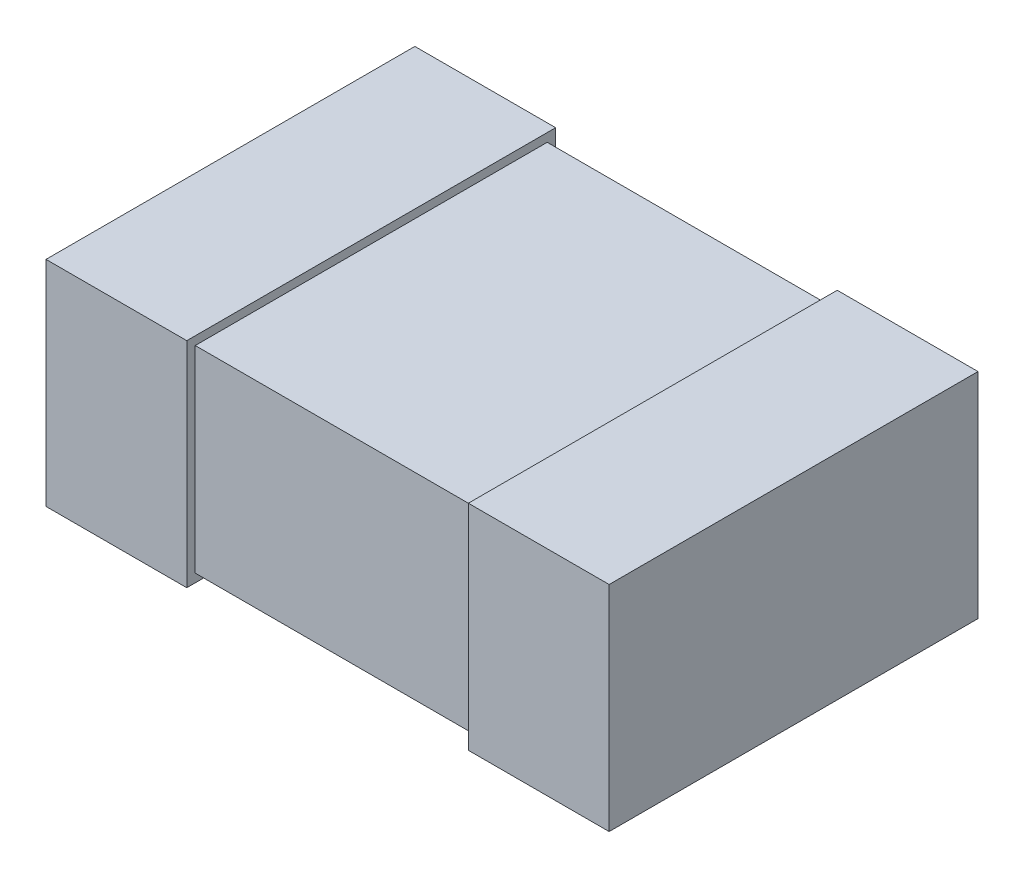
ISO-10303-21;
HEADER;
FILE_DESCRIPTION(('STEP AP214'),'2;1');
FILE_NAME('part.step','',(''),(''),'','','');
FILE_SCHEMA(('AUTOMOTIVE_DESIGN { 1 0 10303 214 1 1 1 1 }'));
ENDSEC;
DATA;
#1=APPLICATION_CONTEXT('core data for automotive mechanical design processes');
#2=APPLICATION_PROTOCOL_DEFINITION('international standard','automotive_design',2000,#1);
#3=PRODUCT_CONTEXT('',#1,'mechanical');
#4=PRODUCT('Part','Part','',(#3));
#5=PRODUCT_RELATED_PRODUCT_CATEGORY('part','',(#4));
#6=PRODUCT_DEFINITION_FORMATION('','',#4);
#7=PRODUCT_DEFINITION_CONTEXT('part definition',#1,'design');
#8=PRODUCT_DEFINITION('design','',#6,#7);
#9=PRODUCT_DEFINITION_SHAPE('','',#8);
#10=(LENGTH_UNIT() NAMED_UNIT(*) SI_UNIT(.MILLI.,.METRE.));
#11=(NAMED_UNIT(*) PLANE_ANGLE_UNIT() SI_UNIT($,.RADIAN.));
#12=(NAMED_UNIT(*) SI_UNIT($,.STERADIAN.) SOLID_ANGLE_UNIT());
#13=UNCERTAINTY_MEASURE_WITH_UNIT(LENGTH_MEASURE(1.E-05),#10,'distance_accuracy_value','');
#14=(GEOMETRIC_REPRESENTATION_CONTEXT(3) GLOBAL_UNCERTAINTY_ASSIGNED_CONTEXT((#13)) GLOBAL_UNIT_ASSIGNED_CONTEXT((#10,
#11,#12)) REPRESENTATION_CONTEXT('',''));
#15=CARTESIAN_POINT('',(0.,0.,0.));
#16=DIRECTION('',(0.,0.,1.));
#17=DIRECTION('',(1.,0.,0.));
#18=AXIS2_PLACEMENT_3D('',#15,#16,#17);
#19=CARTESIAN_POINT('',(-1.,0.7,0.625));
#20=DIRECTION('',(0.,0.,-1.));
#21=DIRECTION('',(-1.,0.,0.));
#22=AXIS2_PLACEMENT_3D('',#19,#20,#21);
#23=PLANE('',#22);
#24=DIRECTION('',(0.,-1.,0.));
#25=VECTOR('',#24,1.);
#26=CARTESIAN_POINT('',(0.5,0.7,0.625));
#27=LINE('',#26,#25);
#28=CARTESIAN_POINT('',(0.5,0.7,0.625));
#29=VERTEX_POINT('',#28);
#30=CARTESIAN_POINT('',(0.5,0.,0.625));
#31=VERTEX_POINT('',#30);
#32=EDGE_CURVE('E51',#29,#31,#27,.T.);
#33=ORIENTED_EDGE('',*,*,#32,.F.);
#34=DIRECTION('',(1.,0.,0.));
#35=VECTOR('',#34,1.);
#36=CARTESIAN_POINT('',(-1.,0.7,0.625));
#37=LINE('',#36,#35);
#38=CARTESIAN_POINT('',(-0.5,0.7,0.625));
#39=VERTEX_POINT('',#38);
#40=EDGE_CURVE('E216',#39,#29,#37,.T.);
#41=ORIENTED_EDGE('',*,*,#40,.F.);
#42=DIRECTION('',(0.,1.,0.));
#43=VECTOR('',#42,1.);
#44=CARTESIAN_POINT('',(-0.5,0.7,0.625));
#45=LINE('',#44,#43);
#46=CARTESIAN_POINT('',(-0.5,0.,0.625));
#47=VERTEX_POINT('',#46);
#48=EDGE_CURVE('E210',#47,#39,#45,.T.);
#49=ORIENTED_EDGE('',*,*,#48,.F.);
#50=DIRECTION('',(1.,0.,0.));
#51=VECTOR('',#50,1.);
#52=CARTESIAN_POINT('',(-1.,0.,0.625));
#53=LINE('',#52,#51);
#54=EDGE_CURVE('E215',#47,#31,#53,.T.);
#55=ORIENTED_EDGE('',*,*,#54,.T.);
#56=EDGE_LOOP('',(#33,#41,#49,#55));
#57=FACE_BOUND('',#56,.T.);
#58=ADVANCED_FACE('F36',(#57),#23,.F.);
#59=CARTESIAN_POINT('',(-1.,0.7,-0.625));
#60=DIRECTION('',(0.,0.,1.));
#61=DIRECTION('',(1.,0.,0.));
#62=AXIS2_PLACEMENT_3D('',#59,#60,#61);
#63=PLANE('',#62);
#64=DIRECTION('',(0.,1.,0.));
#65=VECTOR('',#64,1.);
#66=CARTESIAN_POINT('',(0.5,0.7,-0.625));
#67=LINE('',#66,#65);
#68=CARTESIAN_POINT('',(0.5,0.,-0.625));
#69=VERTEX_POINT('',#68);
#70=CARTESIAN_POINT('',(0.5,0.7,-0.625));
#71=VERTEX_POINT('',#70);
#72=EDGE_CURVE('E165',#69,#71,#67,.T.);
#73=ORIENTED_EDGE('',*,*,#72,.F.);
#74=DIRECTION('',(-1.,0.,0.));
#75=VECTOR('',#74,1.);
#76=CARTESIAN_POINT('',(-1.,0.,-0.625));
#77=LINE('',#76,#75);
#78=CARTESIAN_POINT('',(-0.5,0.,-0.625));
#79=VERTEX_POINT('',#78);
#80=EDGE_CURVE('E219',#69,#79,#77,.T.);
#81=ORIENTED_EDGE('',*,*,#80,.T.);
#82=DIRECTION('',(0.,-1.,0.));
#83=VECTOR('',#82,1.);
#84=CARTESIAN_POINT('',(-0.5,0.7,-0.625));
#85=LINE('',#84,#83);
#86=CARTESIAN_POINT('',(-0.5,0.7,-0.625));
#87=VERTEX_POINT('',#86);
#88=EDGE_CURVE('E198',#87,#79,#85,.T.);
#89=ORIENTED_EDGE('',*,*,#88,.F.);
#90=DIRECTION('',(-1.,0.,0.));
#91=VECTOR('',#90,1.);
#92=CARTESIAN_POINT('',(-1.,0.7,-0.625));
#93=LINE('',#92,#91);
#94=EDGE_CURVE('E218',#71,#87,#93,.T.);
#95=ORIENTED_EDGE('',*,*,#94,.F.);
#96=EDGE_LOOP('',(#73,#81,#89,#95));
#97=FACE_BOUND('',#96,.T.);
#98=ADVANCED_FACE('F236',(#97),#63,.F.);
#99=CARTESIAN_POINT('',(-1.,0.7,0.625));
#100=DIRECTION('',(0.,1.,0.));
#101=DIRECTION('',(0.,0.,1.));
#102=AXIS2_PLACEMENT_3D('',#99,#100,#101);
#103=PLANE('',#102);
#104=ORIENTED_EDGE('',*,*,#40,.T.);
#105=DIRECTION('',(0.,0.,-1.));
#106=VECTOR('',#105,1.);
#107=CARTESIAN_POINT('',(0.5,0.7,0.625));
#108=LINE('',#107,#106);
#109=EDGE_CURVE('E58',#29,#71,#108,.T.);
#110=ORIENTED_EDGE('',*,*,#109,.T.);
#111=ORIENTED_EDGE('',*,*,#94,.T.);
#112=DIRECTION('',(0.,0.,1.));
#113=VECTOR('',#112,1.);
#114=CARTESIAN_POINT('',(-0.5,0.7,0.625));
#115=LINE('',#114,#113);
#116=EDGE_CURVE('E213',#87,#39,#115,.T.);
#117=ORIENTED_EDGE('',*,*,#116,.T.);
#118=EDGE_LOOP('',(#104,#110,#111,#117));
#119=FACE_BOUND('',#118,.T.);
#120=ADVANCED_FACE('F233',(#119),#103,.T.);
#121=CARTESIAN_POINT('',(-1.,0.,0.625));
#122=DIRECTION('',(0.,1.,0.));
#123=DIRECTION('',(0.,0.,1.));
#124=AXIS2_PLACEMENT_3D('',#121,#122,#123);
#125=PLANE('',#124);
#126=DIRECTION('',(0.,0.,-1.));
#127=VECTOR('',#126,1.);
#128=CARTESIAN_POINT('',(0.5,0.,0.625));
#129=LINE('',#128,#127);
#130=EDGE_CURVE('E12',#31,#69,#129,.T.);
#131=ORIENTED_EDGE('',*,*,#130,.F.);
#132=ORIENTED_EDGE('',*,*,#54,.F.);
#133=DIRECTION('',(0.,0.,1.));
#134=VECTOR('',#133,1.);
#135=CARTESIAN_POINT('',(-0.5,0.,0.625));
#136=LINE('',#135,#134);
#137=EDGE_CURVE('E44',#79,#47,#136,.T.);
#138=ORIENTED_EDGE('',*,*,#137,.F.);
#139=ORIENTED_EDGE('',*,*,#80,.F.);
#140=EDGE_LOOP('',(#131,#132,#138,#139));
#141=FACE_BOUND('',#140,.T.);
#142=ADVANCED_FACE('F231',(#141),#125,.F.);
#143=CARTESIAN_POINT('',(-0.5,-0.0299999999999997,1.59472523324353));
#144=DIRECTION('',(0.,1.,0.));
#145=DIRECTION('',(-1.,0.,0.));
#146=AXIS2_PLACEMENT_3D('',#143,#144,#145);
#147=PLANE('',#146);
#148=DIRECTION('',(0.,0.,-1.));
#149=VECTOR('',#148,1.);
#150=CARTESIAN_POINT('',(-0.5,-0.0299999999999997,1.59472523324353));
#151=LINE('',#150,#149);
#152=CARTESIAN_POINT('',(-0.5,-0.0299999999999997,0.655));
#153=VERTEX_POINT('',#152);
#154=CARTESIAN_POINT('',(-0.5,-0.0299999999999997,-0.655));
#155=VERTEX_POINT('',#154);
#156=EDGE_CURVE('E187',#153,#155,#151,.T.);
#157=ORIENTED_EDGE('',*,*,#156,.F.);
#158=DIRECTION('',(-1.,0.,0.));
#159=VECTOR('',#158,1.);
#160=CARTESIAN_POINT('',(-0.5,-0.0299999999999997,0.655));
#161=LINE('',#160,#159);
#162=CARTESIAN_POINT('',(-1.,-0.0299999999999998,0.655));
#163=VERTEX_POINT('',#162);
#164=EDGE_CURVE('E192',#153,#163,#161,.T.);
#165=ORIENTED_EDGE('',*,*,#164,.T.);
#166=DIRECTION('',(0.,0.,-1.));
#167=VECTOR('',#166,1.);
#168=CARTESIAN_POINT('',(-1.,-0.0299999999999998,1.59472523324353));
#169=LINE('',#168,#167);
#170=CARTESIAN_POINT('',(-1.,-0.0299999999999998,-0.655));
#171=VERTEX_POINT('',#170);
#172=EDGE_CURVE('E200',#163,#171,#169,.T.);
#173=ORIENTED_EDGE('',*,*,#172,.T.);
#174=DIRECTION('',(-1.,0.,0.));
#175=VECTOR('',#174,1.);
#176=CARTESIAN_POINT('',(-0.5,-0.0299999999999997,-0.655));
#177=LINE('',#176,#175);
#178=EDGE_CURVE('E178',#155,#171,#177,.T.);
#179=ORIENTED_EDGE('',*,*,#178,.F.);
#180=EDGE_LOOP('',(#157,#165,#173,#179));
#181=FACE_BOUND('',#180,.T.);
#182=ADVANCED_FACE('F277',(#181),#147,.F.);
#183=CARTESIAN_POINT('',(-0.5,0.73,1.59472523324353));
#184=DIRECTION('',(0.,-1.,0.));
#185=DIRECTION('',(1.,0.,0.));
#186=AXIS2_PLACEMENT_3D('',#183,#184,#185);
#187=PLANE('',#186);
#188=DIRECTION('',(0.,0.,-1.));
#189=VECTOR('',#188,1.);
#190=CARTESIAN_POINT('',(-1.,0.73,1.59472523324353));
#191=LINE('',#190,#189);
#192=CARTESIAN_POINT('',(-1.,0.73,0.655));
#193=VERTEX_POINT('',#192);
#194=CARTESIAN_POINT('',(-1.,0.73,-0.655));
#195=VERTEX_POINT('',#194);
#196=EDGE_CURVE('E202',#193,#195,#191,.T.);
#197=ORIENTED_EDGE('',*,*,#196,.F.);
#198=DIRECTION('',(1.,0.,0.));
#199=VECTOR('',#198,1.);
#200=CARTESIAN_POINT('',(-0.5,0.73,0.655));
#201=LINE('',#200,#199);
#202=CARTESIAN_POINT('',(-0.5,0.73,0.655));
#203=VERTEX_POINT('',#202);
#204=EDGE_CURVE('E191',#193,#203,#201,.T.);
#205=ORIENTED_EDGE('',*,*,#204,.T.);
#206=DIRECTION('',(0.,0.,-1.));
#207=VECTOR('',#206,1.);
#208=CARTESIAN_POINT('',(-0.5,0.73,1.59472523324353));
#209=LINE('',#208,#207);
#210=CARTESIAN_POINT('',(-0.5,0.73,-0.655));
#211=VERTEX_POINT('',#210);
#212=EDGE_CURVE('E204',#203,#211,#209,.T.);
#213=ORIENTED_EDGE('',*,*,#212,.T.);
#214=DIRECTION('',(1.,0.,0.));
#215=VECTOR('',#214,1.);
#216=CARTESIAN_POINT('',(-0.5,0.73,-0.655));
#217=LINE('',#216,#215);
#218=EDGE_CURVE('E184',#195,#211,#217,.T.);
#219=ORIENTED_EDGE('',*,*,#218,.F.);
#220=EDGE_LOOP('',(#197,#205,#213,#219));
#221=FACE_BOUND('',#220,.T.);
#222=ADVANCED_FACE('F280',(#221),#187,.F.);
#223=CARTESIAN_POINT('',(-0.5,0.73,1.59472523324353));
#224=DIRECTION('',(-1.,0.,0.));
#225=DIRECTION('',(0.,0.,1.));
#226=AXIS2_PLACEMENT_3D('',#223,#224,#225);
#227=PLANE('',#226);
#228=ORIENTED_EDGE('',*,*,#116,.F.);
#229=ORIENTED_EDGE('',*,*,#88,.T.);
#230=ORIENTED_EDGE('',*,*,#137,.T.);
#231=ORIENTED_EDGE('',*,*,#48,.T.);
#232=EDGE_LOOP('',(#228,#229,#230,#231));
#233=FACE_BOUND('',#232,.T.);
#234=ORIENTED_EDGE('',*,*,#212,.F.);
#235=DIRECTION('',(0.,-1.,0.));
#236=VECTOR('',#235,1.);
#237=CARTESIAN_POINT('',(-0.5,0.73,0.655));
#238=LINE('',#237,#236);
#239=EDGE_CURVE('E195',#203,#153,#238,.T.);
#240=ORIENTED_EDGE('',*,*,#239,.T.);
#241=ORIENTED_EDGE('',*,*,#156,.T.);
#242=DIRECTION('',(0.,-1.,0.));
#243=VECTOR('',#242,1.);
#244=CARTESIAN_POINT('',(-0.5,0.73,-0.655));
#245=LINE('',#244,#243);
#246=EDGE_CURVE('E181',#211,#155,#245,.T.);
#247=ORIENTED_EDGE('',*,*,#246,.F.);
#248=EDGE_LOOP('',(#234,#240,#241,#247));
#249=FACE_BOUND('',#248,.T.);
#250=ADVANCED_FACE('F226',(#233,#249),#227,.F.);
#251=CARTESIAN_POINT('',(-1.,0.7,0.655));
#252=DIRECTION('',(0.,0.,-1.));
#253=DIRECTION('',(-1.,0.,0.));
#254=AXIS2_PLACEMENT_3D('',#251,#252,#253);
#255=PLANE('',#254);
#256=ORIENTED_EDGE('',*,*,#204,.F.);
#257=DIRECTION('',(0.,1.,0.));
#258=VECTOR('',#257,1.);
#259=CARTESIAN_POINT('',(-1.,0.73,0.655));
#260=LINE('',#259,#258);
#261=EDGE_CURVE('E188',#163,#193,#260,.T.);
#262=ORIENTED_EDGE('',*,*,#261,.F.);
#263=ORIENTED_EDGE('',*,*,#164,.F.);
#264=ORIENTED_EDGE('',*,*,#239,.F.);
#265=EDGE_LOOP('',(#256,#262,#263,#264));
#266=FACE_BOUND('',#265,.T.);
#267=ADVANCED_FACE('F272',(#266),#255,.F.);
#268=CARTESIAN_POINT('',(-1.,0.7,-0.655));
#269=DIRECTION('',(0.,0.,1.));
#270=DIRECTION('',(1.,0.,0.));
#271=AXIS2_PLACEMENT_3D('',#268,#269,#270);
#272=PLANE('',#271);
#273=ORIENTED_EDGE('',*,*,#246,.T.);
#274=ORIENTED_EDGE('',*,*,#178,.T.);
#275=DIRECTION('',(0.,1.,0.));
#276=VECTOR('',#275,1.);
#277=CARTESIAN_POINT('',(-1.,0.73,-0.655));
#278=LINE('',#277,#276);
#279=EDGE_CURVE('E175',#171,#195,#278,.T.);
#280=ORIENTED_EDGE('',*,*,#279,.T.);
#281=ORIENTED_EDGE('',*,*,#218,.T.);
#282=EDGE_LOOP('',(#273,#274,#280,#281));
#283=FACE_BOUND('',#282,.T.);
#284=ADVANCED_FACE('F269',(#283),#272,.F.);
#285=CARTESIAN_POINT('',(-1.,0.7,-0.625));
#286=DIRECTION('',(1.,0.,0.));
#287=DIRECTION('',(0.,0.,-1.));
#288=AXIS2_PLACEMENT_3D('',#285,#286,#287);
#289=PLANE('',#288);
#290=ORIENTED_EDGE('',*,*,#172,.F.);
#291=ORIENTED_EDGE('',*,*,#261,.T.);
#292=ORIENTED_EDGE('',*,*,#196,.T.);
#293=ORIENTED_EDGE('',*,*,#279,.F.);
#294=EDGE_LOOP('',(#290,#291,#292,#293));
#295=FACE_BOUND('',#294,.T.);
#296=ADVANCED_FACE('F38',(#295),#289,.F.);
#297=CARTESIAN_POINT('',(0.5,-0.0299999999999996,1.59472523324353));
#298=DIRECTION('',(0.,1.,0.));
#299=DIRECTION('',(-1.,0.,0.));
#300=AXIS2_PLACEMENT_3D('',#297,#298,#299);
#301=PLANE('',#300);
#302=DIRECTION('',(0.,0.,-1.));
#303=VECTOR('',#302,1.);
#304=CARTESIAN_POINT('',(1.,-0.0299999999999995,1.59472523324353));
#305=LINE('',#304,#303);
#306=CARTESIAN_POINT('',(1.,-0.0299999999999995,0.655));
#307=VERTEX_POINT('',#306);
#308=CARTESIAN_POINT('',(1.,-0.0299999999999995,-0.655));
#309=VERTEX_POINT('',#308);
#310=EDGE_CURVE('E138',#307,#309,#305,.T.);
#311=ORIENTED_EDGE('',*,*,#310,.F.);
#312=DIRECTION('',(-1.,0.,0.));
#313=VECTOR('',#312,1.);
#314=CARTESIAN_POINT('',(0.5,-0.0299999999999996,0.655));
#315=LINE('',#314,#313);
#316=CARTESIAN_POINT('',(0.5,-0.0299999999999996,0.655));
#317=VERTEX_POINT('',#316);
#318=EDGE_CURVE('E133',#307,#317,#315,.T.);
#319=ORIENTED_EDGE('',*,*,#318,.T.);
#320=DIRECTION('',(0.,0.,-1.));
#321=VECTOR('',#320,1.);
#322=CARTESIAN_POINT('',(0.5,-0.0299999999999996,1.59472523324353));
#323=LINE('',#322,#321);
#324=CARTESIAN_POINT('',(0.5,-0.0299999999999996,-0.655));
#325=VERTEX_POINT('',#324);
#326=EDGE_CURVE('E128',#317,#325,#323,.T.);
#327=ORIENTED_EDGE('',*,*,#326,.T.);
#328=DIRECTION('',(-1.,0.,0.));
#329=VECTOR('',#328,1.);
#330=CARTESIAN_POINT('',(0.500000000000001,-0.0299999999999996,-0.655));
#331=LINE('',#330,#329);
#332=EDGE_CURVE('E132',#309,#325,#331,.T.);
#333=ORIENTED_EDGE('',*,*,#332,.F.);
#334=EDGE_LOOP('',(#311,#319,#327,#333));
#335=FACE_BOUND('',#334,.T.);
#336=ADVANCED_FACE('F131',(#335),#301,.F.);
#337=CARTESIAN_POINT('',(0.5,0.73,1.59472523324353));
#338=DIRECTION('',(1.,0.,0.));
#339=DIRECTION('',(0.,0.,-1.));
#340=AXIS2_PLACEMENT_3D('',#337,#338,#339);
#341=PLANE('',#340);
#342=ORIENTED_EDGE('',*,*,#109,.F.);
#343=ORIENTED_EDGE('',*,*,#32,.T.);
#344=ORIENTED_EDGE('',*,*,#130,.T.);
#345=ORIENTED_EDGE('',*,*,#72,.T.);
#346=EDGE_LOOP('',(#342,#343,#344,#345));
#347=FACE_BOUND('',#346,.T.);
#348=ORIENTED_EDGE('',*,*,#326,.F.);
#349=DIRECTION('',(0.,1.,0.));
#350=VECTOR('',#349,1.);
#351=CARTESIAN_POINT('',(0.5,0.73,0.655));
#352=LINE('',#351,#350);
#353=CARTESIAN_POINT('',(0.5,0.73,0.655));
#354=VERTEX_POINT('',#353);
#355=EDGE_CURVE('E160',#317,#354,#352,.T.);
#356=ORIENTED_EDGE('',*,*,#355,.T.);
#357=DIRECTION('',(0.,0.,-1.));
#358=VECTOR('',#357,1.);
#359=CARTESIAN_POINT('',(0.5,0.73,1.59472523324353));
#360=LINE('',#359,#358);
#361=CARTESIAN_POINT('',(0.5,0.73,-0.655));
#362=VERTEX_POINT('',#361);
#363=EDGE_CURVE('E137',#354,#362,#360,.T.);
#364=ORIENTED_EDGE('',*,*,#363,.T.);
#365=DIRECTION('',(0.,1.,0.));
#366=VECTOR('',#365,1.);
#367=CARTESIAN_POINT('',(0.5,0.73,-0.655));
#368=LINE('',#367,#366);
#369=EDGE_CURVE('E145',#325,#362,#368,.T.);
#370=ORIENTED_EDGE('',*,*,#369,.F.);
#371=EDGE_LOOP('',(#348,#356,#364,#370));
#372=FACE_BOUND('',#371,.T.);
#373=ADVANCED_FACE('F150',(#347,#372),#341,.F.);
#374=CARTESIAN_POINT('',(0.5,0.73,1.59472523324353));
#375=DIRECTION('',(0.,-1.,0.));
#376=DIRECTION('',(0.,0.,-1.));
#377=AXIS2_PLACEMENT_3D('',#374,#375,#376);
#378=PLANE('',#377);
#379=ORIENTED_EDGE('',*,*,#363,.F.);
#380=DIRECTION('',(1.,0.,0.));
#381=VECTOR('',#380,1.);
#382=CARTESIAN_POINT('',(0.5,0.73,0.655));
#383=LINE('',#382,#381);
#384=CARTESIAN_POINT('',(1.,0.73,0.655));
#385=VERTEX_POINT('',#384);
#386=EDGE_CURVE('E163',#354,#385,#383,.T.);
#387=ORIENTED_EDGE('',*,*,#386,.T.);
#388=DIRECTION('',(0.,0.,-1.));
#389=VECTOR('',#388,1.);
#390=CARTESIAN_POINT('',(1.,0.73,1.59472523324353));
#391=LINE('',#390,#389);
#392=CARTESIAN_POINT('',(1.,0.73,-0.655));
#393=VERTEX_POINT('',#392);
#394=EDGE_CURVE('E152',#385,#393,#391,.T.);
#395=ORIENTED_EDGE('',*,*,#394,.T.);
#396=DIRECTION('',(1.,0.,0.));
#397=VECTOR('',#396,1.);
#398=CARTESIAN_POINT('',(0.500000000000001,0.73,-0.655));
#399=LINE('',#398,#397);
#400=EDGE_CURVE('E153',#362,#393,#399,.T.);
#401=ORIENTED_EDGE('',*,*,#400,.F.);
#402=EDGE_LOOP('',(#379,#387,#395,#401));
#403=FACE_BOUND('',#402,.T.);
#404=ADVANCED_FACE('F256',(#403),#378,.F.);
#405=CARTESIAN_POINT('',(-1.,0.7,0.655));
#406=DIRECTION('',(0.,0.,-1.));
#407=DIRECTION('',(-1.,0.,0.));
#408=AXIS2_PLACEMENT_3D('',#405,#406,#407);
#409=PLANE('',#408);
#410=ORIENTED_EDGE('',*,*,#355,.F.);
#411=ORIENTED_EDGE('',*,*,#318,.F.);
#412=DIRECTION('',(0.,-1.,0.));
#413=VECTOR('',#412,1.);
#414=CARTESIAN_POINT('',(1.,0.73,0.655));
#415=LINE('',#414,#413);
#416=EDGE_CURVE('E161',#385,#307,#415,.T.);
#417=ORIENTED_EDGE('',*,*,#416,.F.);
#418=ORIENTED_EDGE('',*,*,#386,.F.);
#419=EDGE_LOOP('',(#410,#411,#417,#418));
#420=FACE_BOUND('',#419,.T.);
#421=ADVANCED_FACE('F252',(#420),#409,.F.);
#422=CARTESIAN_POINT('',(-1.,0.7,-0.655));
#423=DIRECTION('',(0.,0.,1.));
#424=DIRECTION('',(1.,0.,0.));
#425=AXIS2_PLACEMENT_3D('',#422,#423,#424);
#426=PLANE('',#425);
#427=ORIENTED_EDGE('',*,*,#400,.T.);
#428=DIRECTION('',(0.,-1.,0.));
#429=VECTOR('',#428,1.);
#430=CARTESIAN_POINT('',(1.,0.73,-0.655));
#431=LINE('',#430,#429);
#432=EDGE_CURVE('E148',#393,#309,#431,.T.);
#433=ORIENTED_EDGE('',*,*,#432,.T.);
#434=ORIENTED_EDGE('',*,*,#332,.T.);
#435=ORIENTED_EDGE('',*,*,#369,.T.);
#436=EDGE_LOOP('',(#427,#433,#434,#435));
#437=FACE_BOUND('',#436,.T.);
#438=ADVANCED_FACE('F144',(#437),#426,.F.);
#439=CARTESIAN_POINT('',(1.,0.7,-0.625));
#440=DIRECTION('',(-1.,0.,0.));
#441=DIRECTION('',(0.,0.,1.));
#442=AXIS2_PLACEMENT_3D('',#439,#440,#441);
#443=PLANE('',#442);
#444=ORIENTED_EDGE('',*,*,#394,.F.);
#445=ORIENTED_EDGE('',*,*,#416,.T.);
#446=ORIENTED_EDGE('',*,*,#310,.T.);
#447=ORIENTED_EDGE('',*,*,#432,.F.);
#448=EDGE_LOOP('',(#444,#445,#446,#447));
#449=FACE_BOUND('',#448,.T.);
#450=ADVANCED_FACE('F246',(#449),#443,.F.);
#451=CLOSED_SHELL('',(#58,#98,#120,#142,#182,#222,#250,#267,#284,#296,#336,#373,#404,#421,#438,#450));
#452=MANIFOLD_SOLID_BREP('B2',#451);
#453=ADVANCED_BREP_SHAPE_REPRESENTATION('',(#18,#452),#14);
#454=SHAPE_DEFINITION_REPRESENTATION(#9,#453);
ENDSEC;
END-ISO-10303-21;
